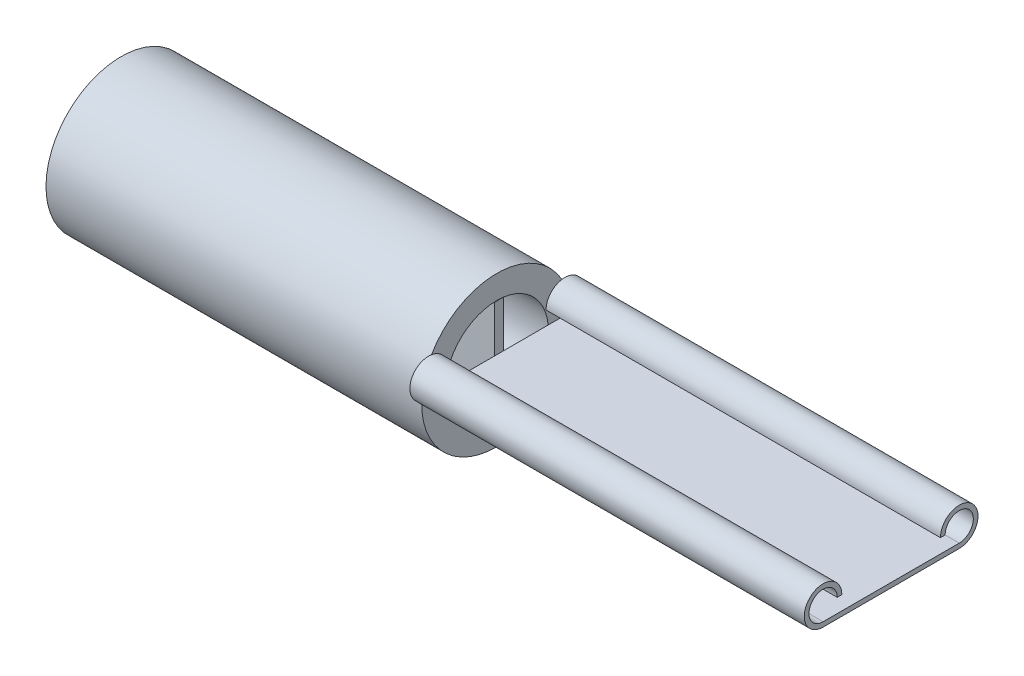
ISO-10303-21;
HEADER;
FILE_DESCRIPTION(('STEP AP214'),'2;1');
FILE_NAME('part.step','',(''),(''),'','','');
FILE_SCHEMA(('AUTOMOTIVE_DESIGN { 1 0 10303 214 1 1 1 1 }'));
ENDSEC;
DATA;
#1=APPLICATION_CONTEXT('core data for automotive mechanical design processes');
#2=APPLICATION_PROTOCOL_DEFINITION('international standard','automotive_design',2000,#1);
#3=PRODUCT_CONTEXT('',#1,'mechanical');
#4=PRODUCT('Part','Part','',(#3));
#5=PRODUCT_RELATED_PRODUCT_CATEGORY('part','',(#4));
#6=PRODUCT_DEFINITION_FORMATION('','',#4);
#7=PRODUCT_DEFINITION_CONTEXT('part definition',#1,'design');
#8=PRODUCT_DEFINITION('design','',#6,#7);
#9=PRODUCT_DEFINITION_SHAPE('','',#8);
#10=(LENGTH_UNIT() NAMED_UNIT(*) SI_UNIT(.MILLI.,.METRE.));
#11=(NAMED_UNIT(*) PLANE_ANGLE_UNIT() SI_UNIT($,.RADIAN.));
#12=(NAMED_UNIT(*) SI_UNIT($,.STERADIAN.) SOLID_ANGLE_UNIT());
#13=UNCERTAINTY_MEASURE_WITH_UNIT(LENGTH_MEASURE(1.E-05),#10,'distance_accuracy_value','');
#14=(GEOMETRIC_REPRESENTATION_CONTEXT(3) GLOBAL_UNCERTAINTY_ASSIGNED_CONTEXT((#13)) GLOBAL_UNIT_ASSIGNED_CONTEXT((#10,
#11,#12)) REPRESENTATION_CONTEXT('',''));
#15=CARTESIAN_POINT('',(0.,0.,0.));
#16=DIRECTION('',(0.,0.,1.));
#17=DIRECTION('',(1.,0.,0.));
#18=AXIS2_PLACEMENT_3D('',#15,#16,#17);
#19=CARTESIAN_POINT('',(8.,1.08987782799353,-0.148883578839629));
#20=DIRECTION('',(0.,0.,-1.));
#21=DIRECTION('',(0.,1.,0.));
#22=AXIS2_PLACEMENT_3D('',#19,#20,#21);
#23=PLANE('',#22);
#24=DIRECTION('',(0.,-1.,0.));
#25=VECTOR('',#24,1.);
#26=CARTESIAN_POINT('',(0.,1.08987782799353,-0.148883578839629));
#27=LINE('',#26,#25);
#28=CARTESIAN_POINT('',(0.,1.08987782799353,-0.148883578839629));
#29=VERTEX_POINT('',#28);
#30=CARTESIAN_POINT('',(0.,-1.09881168153954,-0.148883578839628));
#31=VERTEX_POINT('',#30);
#32=EDGE_CURVE('E108',#29,#31,#27,.T.);
#33=ORIENTED_EDGE('',*,*,#32,.F.);
#34=DIRECTION('',(-1.,0.,0.));
#35=VECTOR('',#34,1.);
#36=CARTESIAN_POINT('',(8.,1.08987782799353,-0.148883578839629));
#37=LINE('',#36,#35);
#38=CARTESIAN_POINT('',(8.,1.08987782799353,-0.148883578839629));
#39=VERTEX_POINT('',#38);
#40=EDGE_CURVE('E12',#39,#29,#37,.T.);
#41=ORIENTED_EDGE('',*,*,#40,.F.);
#42=DIRECTION('',(0.,-1.,0.));
#43=VECTOR('',#42,1.);
#44=CARTESIAN_POINT('',(8.,1.08987782799353,-0.148883578839629));
#45=LINE('',#44,#43);
#46=CARTESIAN_POINT('',(8.,-1.09881168153954,-0.148883578839628));
#47=VERTEX_POINT('',#46);
#48=EDGE_CURVE('E102',#39,#47,#45,.T.);
#49=ORIENTED_EDGE('',*,*,#48,.T.);
#50=DIRECTION('',(-1.,0.,0.));
#51=VECTOR('',#50,1.);
#52=CARTESIAN_POINT('',(8.,-1.09881168153954,-0.148883578839628));
#53=LINE('',#52,#51);
#54=EDGE_CURVE('E47',#47,#31,#53,.T.);
#55=ORIENTED_EDGE('',*,*,#54,.T.);
#56=EDGE_LOOP('',(#33,#41,#49,#55));
#57=FACE_BOUND('',#56,.T.);
#58=ADVANCED_FACE('F44',(#57),#23,.T.);
#59=CARTESIAN_POINT('',(8.,1.08987782799353,-0.148883578839629));
#60=DIRECTION('',(0.,1.,0.));
#61=DIRECTION('',(0.,0.,1.));
#62=AXIS2_PLACEMENT_3D('',#59,#60,#61);
#63=PLANE('',#62);
#64=DIRECTION('',(0.,0.,-1.));
#65=VECTOR('',#64,1.);
#66=CARTESIAN_POINT('',(0.,1.08987782799353,-0.148883578839629));
#67=LINE('',#66,#65);
#68=CARTESIAN_POINT('',(0.,1.08987782799353,0.0511164211603714));
#69=VERTEX_POINT('',#68);
#70=EDGE_CURVE('E104',#69,#29,#67,.T.);
#71=ORIENTED_EDGE('',*,*,#70,.F.);
#72=DIRECTION('',(-1.,0.,0.));
#73=VECTOR('',#72,1.);
#74=CARTESIAN_POINT('',(8.,1.08987782799353,0.0511164211603714));
#75=LINE('',#74,#73);
#76=CARTESIAN_POINT('',(8.,1.08987782799353,0.0511164211603714));
#77=VERTEX_POINT('',#76);
#78=EDGE_CURVE('E53',#77,#69,#75,.T.);
#79=ORIENTED_EDGE('',*,*,#78,.F.);
#80=DIRECTION('',(0.,0.,-1.));
#81=VECTOR('',#80,1.);
#82=CARTESIAN_POINT('',(8.,1.08987782799353,-0.148883578839629));
#83=LINE('',#82,#81);
#84=EDGE_CURVE('E99',#77,#39,#83,.T.);
#85=ORIENTED_EDGE('',*,*,#84,.T.);
#86=ORIENTED_EDGE('',*,*,#40,.T.);
#87=EDGE_LOOP('',(#71,#79,#85,#86));
#88=FACE_BOUND('',#87,.T.);
#89=ADVANCED_FACE('F118',(#88),#63,.T.);
#90=CARTESIAN_POINT('',(8.,1.08987782799353,0.0511164211603714));
#91=DIRECTION('',(0.,0.,1.));
#92=DIRECTION('',(0.,-1.,0.));
#93=AXIS2_PLACEMENT_3D('',#90,#91,#92);
#94=PLANE('',#93);
#95=DIRECTION('',(0.,1.,0.));
#96=VECTOR('',#95,1.);
#97=CARTESIAN_POINT('',(0.,1.08987782799353,0.0511164211603714));
#98=LINE('',#97,#96);
#99=CARTESIAN_POINT('',(0.,-1.09881168153954,0.0511164211603717));
#100=VERTEX_POINT('',#99);
#101=EDGE_CURVE('E94',#100,#69,#98,.T.);
#102=ORIENTED_EDGE('',*,*,#101,.F.);
#103=DIRECTION('',(-1.,0.,0.));
#104=VECTOR('',#103,1.);
#105=CARTESIAN_POINT('',(8.,-1.09881168153954,0.0511164211603717));
#106=LINE('',#105,#104);
#107=CARTESIAN_POINT('',(8.,-1.09881168153954,0.0511164211603717));
#108=VERTEX_POINT('',#107);
#109=EDGE_CURVE('E89',#108,#100,#106,.T.);
#110=ORIENTED_EDGE('',*,*,#109,.F.);
#111=DIRECTION('',(0.,1.,0.));
#112=VECTOR('',#111,1.);
#113=CARTESIAN_POINT('',(8.,1.08987782799353,0.0511164211603714));
#114=LINE('',#113,#112);
#115=EDGE_CURVE('E92',#108,#77,#114,.T.);
#116=ORIENTED_EDGE('',*,*,#115,.T.);
#117=ORIENTED_EDGE('',*,*,#78,.T.);
#118=EDGE_LOOP('',(#102,#110,#116,#117));
#119=FACE_BOUND('',#118,.T.);
#120=ADVANCED_FACE('F91',(#119),#94,.T.);
#121=CARTESIAN_POINT('',(8.,-1.09881168153954,-0.148883578839628));
#122=DIRECTION('',(0.,-1.,0.));
#123=DIRECTION('',(0.,0.,-1.));
#124=AXIS2_PLACEMENT_3D('',#121,#122,#123);
#125=PLANE('',#124);
#126=DIRECTION('',(0.,0.,1.));
#127=VECTOR('',#126,1.);
#128=CARTESIAN_POINT('',(0.,-1.09881168153954,-0.148883578839628));
#129=LINE('',#128,#127);
#130=EDGE_CURVE('E111',#31,#100,#129,.T.);
#131=ORIENTED_EDGE('',*,*,#130,.F.);
#132=ORIENTED_EDGE('',*,*,#54,.F.);
#133=DIRECTION('',(0.,0.,1.));
#134=VECTOR('',#133,1.);
#135=CARTESIAN_POINT('',(8.,-1.09881168153954,-0.148883578839628));
#136=LINE('',#135,#134);
#137=EDGE_CURVE('E98',#47,#108,#136,.T.);
#138=ORIENTED_EDGE('',*,*,#137,.T.);
#139=ORIENTED_EDGE('',*,*,#109,.T.);
#140=EDGE_LOOP('',(#131,#132,#138,#139));
#141=FACE_BOUND('',#140,.T.);
#142=ADVANCED_FACE('F101',(#141),#125,.T.);
#143=CARTESIAN_POINT('',(8.,0.,0.));
#144=DIRECTION('',(-1.,0.,0.));
#145=DIRECTION('',(0.,0.,1.));
#146=AXIS2_PLACEMENT_3D('',#143,#144,#145);
#147=PLANE('',#146);
#148=ORIENTED_EDGE('',*,*,#48,.F.);
#149=ORIENTED_EDGE('',*,*,#84,.F.);
#150=ORIENTED_EDGE('',*,*,#115,.F.);
#151=ORIENTED_EDGE('',*,*,#137,.F.);
#152=EDGE_LOOP('',(#148,#149,#150,#151));
#153=FACE_BOUND('',#152,.T.);
#154=ADVANCED_FACE('F97',(#153),#147,.F.);
#155=CARTESIAN_POINT('',(0.,0.,0.));
#156=DIRECTION('',(-1.,0.,0.));
#157=DIRECTION('',(0.,0.,1.));
#158=AXIS2_PLACEMENT_3D('',#155,#156,#157);
#159=PLANE('',#158);
#160=ORIENTED_EDGE('',*,*,#32,.T.);
#161=ORIENTED_EDGE('',*,*,#130,.T.);
#162=ORIENTED_EDGE('',*,*,#101,.T.);
#163=ORIENTED_EDGE('',*,*,#70,.T.);
#164=EDGE_LOOP('',(#160,#161,#162,#163));
#165=FACE_BOUND('',#164,.T.);
#166=ADVANCED_FACE('F117',(#165),#159,.T.);
#167=CLOSED_SHELL('',(#58,#89,#120,#142,#154,#166));
#168=MANIFOLD_SOLID_BREP('B2',#167);
#169=CARTESIAN_POINT('',(8.,0.,0.));
#170=DIRECTION('',(1.,0.,0.));
#171=DIRECTION('',(0.,0.,-1.));
#172=AXIS2_PLACEMENT_3D('',#169,#170,#171);
#173=PLANE('',#172);
#174=CARTESIAN_POINT('',(8.,0.4,1.45));
#175=DIRECTION('',(1.,0.,0.));
#176=DIRECTION('',(0.,0.,1.));
#177=AXIS2_PLACEMENT_3D('',#174,#175,#176);
#178=CIRCLE('',#177,0.4);
#179=CARTESIAN_POINT('',(8.,0.4,1.05));
#180=VERTEX_POINT('',#179);
#181=CARTESIAN_POINT('',(8.,0.795226140008558,1.38838589241143));
#182=VERTEX_POINT('',#181);
#183=EDGE_CURVE('E186',#180,#182,#178,.T.);
#184=ORIENTED_EDGE('',*,*,#183,.F.);
#185=DIRECTION('',(0.,0.,-1.));
#186=VECTOR('',#185,1.);
#187=CARTESIAN_POINT('',(8.,0.4,1.05));
#188=LINE('',#187,#186);
#189=CARTESIAN_POINT('',(8.,0.4,1.15));
#190=VERTEX_POINT('',#189);
#191=EDGE_CURVE('E293',#190,#180,#188,.T.);
#192=ORIENTED_EDGE('',*,*,#191,.F.);
#193=CARTESIAN_POINT('',(8.,0.4,1.45));
#194=DIRECTION('',(-1.,0.,0.));
#195=DIRECTION('',(0.,0.,1.));
#196=AXIS2_PLACEMENT_3D('',#193,#194,#195);
#197=CIRCLE('',#196,0.3);
#198=CARTESIAN_POINT('',(8.,0.699792734645293,1.43885028009785));
#199=VERTEX_POINT('',#198);
#200=EDGE_CURVE('E42',#199,#190,#197,.T.);
#201=ORIENTED_EDGE('',*,*,#200,.F.);
#202=CARTESIAN_POINT('',(8.,0.,0.));
#203=DIRECTION('',(1.,0.,0.));
#204=DIRECTION('',(0.,0.,-1.));
#205=AXIS2_PLACEMENT_3D('',#202,#203,#204);
#206=CIRCLE('',#205,1.6);
#207=CARTESIAN_POINT('',(8.,0.136892348227635,1.59413314531651));
#208=VERTEX_POINT('',#207);
#209=EDGE_CURVE('E330',#199,#208,#206,.T.);
#210=ORIENTED_EDGE('',*,*,#209,.T.);
#211=CARTESIAN_POINT('',(8.,0.1,1.45));
#212=VERTEX_POINT('',#211);
#213=EDGE_CURVE('E178',#212,#208,#197,.T.);
#214=ORIENTED_EDGE('',*,*,#213,.F.);
#215=DIRECTION('',(0.,0.,1.));
#216=VECTOR('',#215,1.);
#217=CARTESIAN_POINT('',(8.,0.1,1.45));
#218=LINE('',#217,#216);
#219=CARTESIAN_POINT('',(8.,0.1,1.09544511501033));
#220=VERTEX_POINT('',#219);
#221=EDGE_CURVE('E176',#220,#212,#218,.T.);
#222=ORIENTED_EDGE('',*,*,#221,.F.);
#223=CARTESIAN_POINT('',(8.,0.,0.));
#224=DIRECTION('',(1.,0.,0.));
#225=DIRECTION('',(0.,0.,-1.));
#226=AXIS2_PLACEMENT_3D('',#223,#224,#225);
#227=CIRCLE('',#226,1.1);
#228=CARTESIAN_POINT('',(8.,0.1,-1.09544511501033));
#229=VERTEX_POINT('',#228);
#230=EDGE_CURVE('E310',#229,#220,#227,.T.);
#231=ORIENTED_EDGE('',*,*,#230,.F.);
#232=CARTESIAN_POINT('',(8.,0.1,-1.45));
#233=VERTEX_POINT('',#232);
#234=EDGE_CURVE('E390',#233,#229,#218,.T.);
#235=ORIENTED_EDGE('',*,*,#234,.F.);
#236=CARTESIAN_POINT('',(8.,0.4,-1.45));
#237=DIRECTION('',(-1.,0.,0.));
#238=DIRECTION('',(0.,0.,-1.));
#239=AXIS2_PLACEMENT_3D('',#236,#237,#238);
#240=CIRCLE('',#239,0.3);
#241=CARTESIAN_POINT('',(8.,0.136892348227635,-1.59413314531651));
#242=VERTEX_POINT('',#241);
#243=EDGE_CURVE('E389',#242,#233,#240,.T.);
#244=ORIENTED_EDGE('',*,*,#243,.F.);
#245=CARTESIAN_POINT('',(8.,0.699792734645293,-1.43885028009785));
#246=VERTEX_POINT('',#245);
#247=EDGE_CURVE('E314',#242,#246,#206,.T.);
#248=ORIENTED_EDGE('',*,*,#247,.T.);
#249=CARTESIAN_POINT('',(8.,0.4,-1.15));
#250=VERTEX_POINT('',#249);
#251=EDGE_CURVE('E385',#250,#246,#240,.T.);
#252=ORIENTED_EDGE('',*,*,#251,.F.);
#253=DIRECTION('',(0.,0.,-1.));
#254=VECTOR('',#253,1.);
#255=CARTESIAN_POINT('',(8.,0.4,-1.05));
#256=LINE('',#255,#254);
#257=CARTESIAN_POINT('',(8.,0.4,-1.05));
#258=VERTEX_POINT('',#257);
#259=EDGE_CURVE('E381',#258,#250,#256,.T.);
#260=ORIENTED_EDGE('',*,*,#259,.F.);
#261=CARTESIAN_POINT('',(8.,0.4,-1.45));
#262=DIRECTION('',(1.,0.,0.));
#263=DIRECTION('',(0.,0.,-1.));
#264=AXIS2_PLACEMENT_3D('',#261,#262,#263);
#265=CIRCLE('',#264,0.4);
#266=CARTESIAN_POINT('',(8.,0.795226140008558,-1.38838589241143));
#267=VERTEX_POINT('',#266);
#268=EDGE_CURVE('E364',#267,#258,#265,.T.);
#269=ORIENTED_EDGE('',*,*,#268,.F.);
#270=EDGE_CURVE('E424',#267,#182,#206,.T.);
#271=ORIENTED_EDGE('',*,*,#270,.T.);
#272=EDGE_LOOP('',(#184,#192,#201,#210,#214,#222,#231,#235,#244,#248,#252,#260,#269,#271));
#273=FACE_BOUND('',#272,.T.);
#274=ADVANCED_FACE('F167',(#273),#173,.T.);
#275=CARTESIAN_POINT('',(8.,0.0290832522566356,1.59973565454989));
#276=VERTEX_POINT('',#275);
#277=CARTESIAN_POINT('',(8.,0.,1.45));
#278=VERTEX_POINT('',#277);
#279=EDGE_CURVE('E298',#276,#278,#178,.T.);
#280=ORIENTED_EDGE('',*,*,#279,.F.);
#281=CARTESIAN_POINT('',(8.,0.0290832522566356,-1.59973565454989));
#282=VERTEX_POINT('',#281);
#283=EDGE_CURVE('E315',#276,#282,#206,.T.);
#284=ORIENTED_EDGE('',*,*,#283,.T.);
#285=CARTESIAN_POINT('',(8.,0.,-1.45));
#286=VERTEX_POINT('',#285);
#287=EDGE_CURVE('E378',#286,#282,#265,.T.);
#288=ORIENTED_EDGE('',*,*,#287,.F.);
#289=DIRECTION('',(0.,0.,-1.));
#290=VECTOR('',#289,1.);
#291=CARTESIAN_POINT('',(8.,0.,1.45));
#292=LINE('',#291,#290);
#293=CARTESIAN_POINT('',(8.,0.,-1.1));
#294=VERTEX_POINT('',#293);
#295=EDGE_CURVE('E313',#294,#286,#292,.T.);
#296=ORIENTED_EDGE('',*,*,#295,.F.);
#297=CARTESIAN_POINT('',(8.,0.,1.1));
#298=VERTEX_POINT('',#297);
#299=EDGE_CURVE('E302',#298,#294,#227,.T.);
#300=ORIENTED_EDGE('',*,*,#299,.F.);
#301=EDGE_CURVE('E322',#278,#298,#292,.T.);
#302=ORIENTED_EDGE('',*,*,#301,.F.);
#303=EDGE_LOOP('',(#280,#284,#288,#296,#300,#302));
#304=FACE_BOUND('',#303,.T.);
#305=ADVANCED_FACE('F338',(#304),#173,.T.);
#306=CARTESIAN_POINT('',(0.,0.,0.));
#307=DIRECTION('',(1.,0.,0.));
#308=DIRECTION('',(0.,0.,-1.));
#309=AXIS2_PLACEMENT_3D('',#306,#307,#308);
#310=PLANE('',#309);
#311=CARTESIAN_POINT('',(0.,0.,0.));
#312=DIRECTION('',(1.,0.,0.));
#313=DIRECTION('',(0.,0.,-1.));
#314=AXIS2_PLACEMENT_3D('',#311,#312,#313);
#315=CIRCLE('',#314,1.6);
#316=CARTESIAN_POINT('',(0.,0.,-1.6));
#317=VERTEX_POINT('',#316);
#318=EDGE_CURVE('E171',#317,#317,#315,.T.);
#319=ORIENTED_EDGE('',*,*,#318,.F.);
#320=EDGE_LOOP('',(#319));
#321=FACE_BOUND('',#320,.T.);
#322=CARTESIAN_POINT('',(0.,0.,0.));
#323=DIRECTION('',(1.,0.,0.));
#324=DIRECTION('',(0.,0.,-1.));
#325=AXIS2_PLACEMENT_3D('',#322,#323,#324);
#326=CIRCLE('',#325,1.1);
#327=CARTESIAN_POINT('',(0.,0.,-1.1));
#328=VERTEX_POINT('',#327);
#329=EDGE_CURVE('E299',#328,#328,#326,.T.);
#330=ORIENTED_EDGE('',*,*,#329,.T.);
#331=EDGE_LOOP('',(#330));
#332=FACE_BOUND('',#331,.T.);
#333=ADVANCED_FACE('F335',(#321,#332),#310,.F.);
#334=CARTESIAN_POINT('',(8.,0.,0.));
#335=DIRECTION('',(-1.,0.,0.));
#336=DIRECTION('',(0.,0.,1.));
#337=AXIS2_PLACEMENT_3D('',#334,#335,#336);
#338=CYLINDRICAL_SURFACE('',#337,1.6);
#339=EDGE_CURVE('E311',#282,#242,#206,.T.);
#340=ORIENTED_EDGE('',*,*,#339,.F.);
#341=ORIENTED_EDGE('',*,*,#283,.F.);
#342=EDGE_CURVE('E326',#208,#276,#206,.T.);
#343=ORIENTED_EDGE('',*,*,#342,.F.);
#344=ORIENTED_EDGE('',*,*,#209,.F.);
#345=EDGE_CURVE('E425',#182,#199,#206,.T.);
#346=ORIENTED_EDGE('',*,*,#345,.F.);
#347=ORIENTED_EDGE('',*,*,#270,.F.);
#348=EDGE_CURVE('E325',#246,#267,#206,.T.);
#349=ORIENTED_EDGE('',*,*,#348,.F.);
#350=ORIENTED_EDGE('',*,*,#247,.F.);
#351=EDGE_LOOP('',(#340,#341,#343,#344,#346,#347,#349,#350));
#352=FACE_BOUND('',#351,.T.);
#353=ORIENTED_EDGE('',*,*,#318,.T.);
#354=EDGE_LOOP('',(#353));
#355=FACE_BOUND('',#354,.T.);
#356=ADVANCED_FACE('F169',(#352,#355),#338,.T.);
#357=CARTESIAN_POINT('',(8.,0.,0.));
#358=DIRECTION('',(-1.,0.,0.));
#359=DIRECTION('',(0.,0.,1.));
#360=AXIS2_PLACEMENT_3D('',#357,#358,#359);
#361=CYLINDRICAL_SURFACE('',#360,1.1);
#362=EDGE_CURVE('E308',#294,#229,#227,.T.);
#363=ORIENTED_EDGE('',*,*,#362,.T.);
#364=ORIENTED_EDGE('',*,*,#230,.T.);
#365=EDGE_CURVE('E449',#220,#298,#227,.T.);
#366=ORIENTED_EDGE('',*,*,#365,.T.);
#367=ORIENTED_EDGE('',*,*,#299,.T.);
#368=EDGE_LOOP('',(#363,#364,#366,#367));
#369=FACE_BOUND('',#368,.T.);
#370=ORIENTED_EDGE('',*,*,#329,.F.);
#371=EDGE_LOOP('',(#370));
#372=FACE_BOUND('',#371,.T.);
#373=ADVANCED_FACE('F341',(#369,#372),#361,.F.);
#374=CARTESIAN_POINT('',(8.,0.4,1.45));
#375=DIRECTION('',(-1.,0.,0.));
#376=DIRECTION('',(0.,0.,1.));
#377=AXIS2_PLACEMENT_3D('',#374,#375,#376);
#378=PLANE('',#377);
#379=ORIENTED_EDGE('',*,*,#362,.F.);
#380=EDGE_CURVE('E323',#298,#294,#292,.T.);
#381=ORIENTED_EDGE('',*,*,#380,.F.);
#382=ORIENTED_EDGE('',*,*,#365,.F.);
#383=EDGE_CURVE('E388',#229,#220,#218,.T.);
#384=ORIENTED_EDGE('',*,*,#383,.F.);
#385=EDGE_LOOP('',(#379,#381,#382,#384));
#386=FACE_BOUND('',#385,.T.);
#387=ADVANCED_FACE('F343',(#386),#378,.T.);
#388=EDGE_CURVE('E377',#282,#267,#265,.T.);
#389=ORIENTED_EDGE('',*,*,#388,.F.);
#390=ORIENTED_EDGE('',*,*,#339,.T.);
#391=EDGE_CURVE('E384',#246,#242,#240,.T.);
#392=ORIENTED_EDGE('',*,*,#391,.F.);
#393=ORIENTED_EDGE('',*,*,#348,.T.);
#394=EDGE_LOOP('',(#389,#390,#392,#393));
#395=FACE_BOUND('',#394,.T.);
#396=ADVANCED_FACE('F350',(#395),#378,.T.);
#397=CARTESIAN_POINT('',(16.4,0.4,1.45));
#398=DIRECTION('',(-1.,0.,0.));
#399=DIRECTION('',(0.,0.,1.));
#400=AXIS2_PLACEMENT_3D('',#397,#398,#399);
#401=CYLINDRICAL_SURFACE('',#400,0.4);
#402=ORIENTED_EDGE('',*,*,#183,.T.);
#403=EDGE_CURVE('E366',#182,#276,#178,.T.);
#404=ORIENTED_EDGE('',*,*,#403,.T.);
#405=ORIENTED_EDGE('',*,*,#279,.T.);
#406=DIRECTION('',(-1.,0.,0.));
#407=VECTOR('',#406,1.);
#408=CARTESIAN_POINT('',(16.4,0.,1.45));
#409=LINE('',#408,#407);
#410=CARTESIAN_POINT('',(16.4,0.,1.45));
#411=VERTEX_POINT('',#410);
#412=EDGE_CURVE('E277',#411,#278,#409,.T.);
#413=ORIENTED_EDGE('',*,*,#412,.F.);
#414=CARTESIAN_POINT('',(16.4,0.4,1.45));
#415=DIRECTION('',(1.,0.,0.));
#416=DIRECTION('',(0.,0.,1.));
#417=AXIS2_PLACEMENT_3D('',#414,#415,#416);
#418=CIRCLE('',#417,0.4);
#419=CARTESIAN_POINT('',(16.4,0.4,1.05));
#420=VERTEX_POINT('',#419);
#421=EDGE_CURVE('E284',#420,#411,#418,.T.);
#422=ORIENTED_EDGE('',*,*,#421,.F.);
#423=DIRECTION('',(-1.,0.,0.));
#424=VECTOR('',#423,1.);
#425=CARTESIAN_POINT('',(16.4,0.4,1.05));
#426=LINE('',#425,#424);
#427=EDGE_CURVE('E394',#420,#180,#426,.T.);
#428=ORIENTED_EDGE('',*,*,#427,.T.);
#429=EDGE_LOOP('',(#402,#404,#405,#413,#422,#428));
#430=FACE_BOUND('',#429,.T.);
#431=ADVANCED_FACE('F296',(#430),#401,.T.);
#432=CARTESIAN_POINT('',(16.4,0.,1.45));
#433=DIRECTION('',(0.,1.,0.));
#434=DIRECTION('',(0.,0.,1.));
#435=AXIS2_PLACEMENT_3D('',#432,#433,#434);
#436=PLANE('',#435);
#437=ORIENTED_EDGE('',*,*,#301,.T.);
#438=ORIENTED_EDGE('',*,*,#380,.T.);
#439=ORIENTED_EDGE('',*,*,#295,.T.);
#440=DIRECTION('',(-1.,0.,0.));
#441=VECTOR('',#440,1.);
#442=CARTESIAN_POINT('',(16.4,0.,-1.45));
#443=LINE('',#442,#441);
#444=CARTESIAN_POINT('',(16.4,0.,-1.45));
#445=VERTEX_POINT('',#444);
#446=EDGE_CURVE('E280',#445,#286,#443,.T.);
#447=ORIENTED_EDGE('',*,*,#446,.F.);
#448=DIRECTION('',(0.,0.,-1.));
#449=VECTOR('',#448,1.);
#450=CARTESIAN_POINT('',(16.4,0.,1.45));
#451=LINE('',#450,#449);
#452=EDGE_CURVE('E272',#411,#445,#451,.T.);
#453=ORIENTED_EDGE('',*,*,#452,.F.);
#454=ORIENTED_EDGE('',*,*,#412,.T.);
#455=EDGE_LOOP('',(#437,#438,#439,#447,#453,#454));
#456=FACE_BOUND('',#455,.T.);
#457=ADVANCED_FACE('F275',(#456),#436,.F.);
#458=CARTESIAN_POINT('',(16.4,0.4,-1.45));
#459=DIRECTION('',(-1.,0.,0.));
#460=DIRECTION('',(0.,0.,1.));
#461=AXIS2_PLACEMENT_3D('',#458,#459,#460);
#462=CYLINDRICAL_SURFACE('',#461,0.4);
#463=ORIENTED_EDGE('',*,*,#287,.T.);
#464=ORIENTED_EDGE('',*,*,#388,.T.);
#465=ORIENTED_EDGE('',*,*,#268,.T.);
#466=DIRECTION('',(-1.,0.,0.));
#467=VECTOR('',#466,1.);
#468=CARTESIAN_POINT('',(16.4,0.4,-1.05));
#469=LINE('',#468,#467);
#470=CARTESIAN_POINT('',(16.4,0.4,-1.05));
#471=VERTEX_POINT('',#470);
#472=EDGE_CURVE('E304',#471,#258,#469,.T.);
#473=ORIENTED_EDGE('',*,*,#472,.F.);
#474=CARTESIAN_POINT('',(16.4,0.4,-1.45));
#475=DIRECTION('',(1.,0.,0.));
#476=DIRECTION('',(0.,0.,-1.));
#477=AXIS2_PLACEMENT_3D('',#474,#475,#476);
#478=CIRCLE('',#477,0.4);
#479=EDGE_CURVE('E283',#445,#471,#478,.T.);
#480=ORIENTED_EDGE('',*,*,#479,.F.);
#481=ORIENTED_EDGE('',*,*,#446,.T.);
#482=EDGE_LOOP('',(#463,#464,#465,#473,#480,#481));
#483=FACE_BOUND('',#482,.T.);
#484=ADVANCED_FACE('F416',(#483),#462,.T.);
#485=CARTESIAN_POINT('',(16.4,0.4,-1.05));
#486=DIRECTION('',(0.,1.,0.));
#487=DIRECTION('',(0.,0.,1.));
#488=AXIS2_PLACEMENT_3D('',#485,#486,#487);
#489=PLANE('',#488);
#490=ORIENTED_EDGE('',*,*,#259,.T.);
#491=DIRECTION('',(-1.,0.,0.));
#492=VECTOR('',#491,1.);
#493=CARTESIAN_POINT('',(16.4,0.4,-1.15));
#494=LINE('',#493,#492);
#495=CARTESIAN_POINT('',(16.4,0.4,-1.15));
#496=VERTEX_POINT('',#495);
#497=EDGE_CURVE('E405',#496,#250,#494,.T.);
#498=ORIENTED_EDGE('',*,*,#497,.F.);
#499=DIRECTION('',(0.,0.,-1.));
#500=VECTOR('',#499,1.);
#501=CARTESIAN_POINT('',(16.4,0.4,-1.05));
#502=LINE('',#501,#500);
#503=EDGE_CURVE('E413',#471,#496,#502,.T.);
#504=ORIENTED_EDGE('',*,*,#503,.F.);
#505=ORIENTED_EDGE('',*,*,#472,.T.);
#506=EDGE_LOOP('',(#490,#498,#504,#505));
#507=FACE_BOUND('',#506,.T.);
#508=ADVANCED_FACE('F411',(#507),#489,.F.);
#509=CARTESIAN_POINT('',(16.4,0.4,-1.45));
#510=DIRECTION('',(-1.,0.,0.));
#511=DIRECTION('',(0.,0.,1.));
#512=AXIS2_PLACEMENT_3D('',#509,#510,#511);
#513=CYLINDRICAL_SURFACE('',#512,0.3);
#514=ORIENTED_EDGE('',*,*,#251,.T.);
#515=ORIENTED_EDGE('',*,*,#391,.T.);
#516=ORIENTED_EDGE('',*,*,#243,.T.);
#517=DIRECTION('',(-1.,0.,0.));
#518=VECTOR('',#517,1.);
#519=CARTESIAN_POINT('',(16.4,0.1,-1.45));
#520=LINE('',#519,#518);
#521=CARTESIAN_POINT('',(16.4,0.1,-1.45));
#522=VERTEX_POINT('',#521);
#523=EDGE_CURVE('E402',#522,#233,#520,.T.);
#524=ORIENTED_EDGE('',*,*,#523,.F.);
#525=CARTESIAN_POINT('',(16.4,0.4,-1.45));
#526=DIRECTION('',(-1.,0.,0.));
#527=DIRECTION('',(0.,0.,-1.));
#528=AXIS2_PLACEMENT_3D('',#525,#526,#527);
#529=CIRCLE('',#528,0.3);
#530=EDGE_CURVE('E434',#496,#522,#529,.T.);
#531=ORIENTED_EDGE('',*,*,#530,.F.);
#532=ORIENTED_EDGE('',*,*,#497,.T.);
#533=EDGE_LOOP('',(#514,#515,#516,#524,#531,#532));
#534=FACE_BOUND('',#533,.T.);
#535=ADVANCED_FACE('F422',(#534),#513,.F.);
#536=CARTESIAN_POINT('',(16.4,0.1,1.45));
#537=DIRECTION('',(0.,-1.,0.));
#538=DIRECTION('',(0.,0.,-1.));
#539=AXIS2_PLACEMENT_3D('',#536,#537,#538);
#540=PLANE('',#539);
#541=ORIENTED_EDGE('',*,*,#234,.T.);
#542=ORIENTED_EDGE('',*,*,#383,.T.);
#543=ORIENTED_EDGE('',*,*,#221,.T.);
#544=DIRECTION('',(-1.,0.,0.));
#545=VECTOR('',#544,1.);
#546=CARTESIAN_POINT('',(16.4,0.1,1.45));
#547=LINE('',#546,#545);
#548=CARTESIAN_POINT('',(16.4,0.1,1.45));
#549=VERTEX_POINT('',#548);
#550=EDGE_CURVE('E399',#549,#212,#547,.T.);
#551=ORIENTED_EDGE('',*,*,#550,.F.);
#552=DIRECTION('',(0.,0.,1.));
#553=VECTOR('',#552,1.);
#554=CARTESIAN_POINT('',(16.4,0.1,1.45));
#555=LINE('',#554,#553);
#556=EDGE_CURVE('E433',#522,#549,#555,.T.);
#557=ORIENTED_EDGE('',*,*,#556,.F.);
#558=ORIENTED_EDGE('',*,*,#523,.T.);
#559=EDGE_LOOP('',(#541,#542,#543,#551,#557,#558));
#560=FACE_BOUND('',#559,.T.);
#561=ADVANCED_FACE('F443',(#560),#540,.F.);
#562=CARTESIAN_POINT('',(16.4,0.4,1.45));
#563=DIRECTION('',(-1.,0.,0.));
#564=DIRECTION('',(0.,0.,1.));
#565=AXIS2_PLACEMENT_3D('',#562,#563,#564);
#566=CYLINDRICAL_SURFACE('',#565,0.3);
#567=ORIENTED_EDGE('',*,*,#213,.T.);
#568=EDGE_CURVE('E179',#208,#199,#197,.T.);
#569=ORIENTED_EDGE('',*,*,#568,.T.);
#570=ORIENTED_EDGE('',*,*,#200,.T.);
#571=DIRECTION('',(-1.,0.,0.));
#572=VECTOR('',#571,1.);
#573=CARTESIAN_POINT('',(16.4,0.4,1.15));
#574=LINE('',#573,#572);
#575=CARTESIAN_POINT('',(16.4,0.4,1.15));
#576=VERTEX_POINT('',#575);
#577=EDGE_CURVE('E396',#576,#190,#574,.T.);
#578=ORIENTED_EDGE('',*,*,#577,.F.);
#579=CARTESIAN_POINT('',(16.4,0.4,1.45));
#580=DIRECTION('',(-1.,0.,0.));
#581=DIRECTION('',(0.,0.,1.));
#582=AXIS2_PLACEMENT_3D('',#579,#580,#581);
#583=CIRCLE('',#582,0.3);
#584=EDGE_CURVE('E432',#549,#576,#583,.T.);
#585=ORIENTED_EDGE('',*,*,#584,.F.);
#586=ORIENTED_EDGE('',*,*,#550,.T.);
#587=EDGE_LOOP('',(#567,#569,#570,#578,#585,#586));
#588=FACE_BOUND('',#587,.T.);
#589=ADVANCED_FACE('F428',(#588),#566,.F.);
#590=CARTESIAN_POINT('',(16.4,0.4,1.05));
#591=DIRECTION('',(0.,1.,0.));
#592=DIRECTION('',(0.,0.,1.));
#593=AXIS2_PLACEMENT_3D('',#590,#591,#592);
#594=PLANE('',#593);
#595=ORIENTED_EDGE('',*,*,#191,.T.);
#596=ORIENTED_EDGE('',*,*,#427,.F.);
#597=DIRECTION('',(0.,0.,-1.));
#598=VECTOR('',#597,1.);
#599=CARTESIAN_POINT('',(16.4,0.4,1.05));
#600=LINE('',#599,#598);
#601=EDGE_CURVE('E289',#576,#420,#600,.T.);
#602=ORIENTED_EDGE('',*,*,#601,.F.);
#603=ORIENTED_EDGE('',*,*,#577,.T.);
#604=EDGE_LOOP('',(#595,#596,#602,#603));
#605=FACE_BOUND('',#604,.T.);
#606=ADVANCED_FACE('F431',(#605),#594,.F.);
#607=CARTESIAN_POINT('',(16.4,0.4,1.45));
#608=DIRECTION('',(-1.,0.,0.));
#609=DIRECTION('',(0.,0.,1.));
#610=AXIS2_PLACEMENT_3D('',#607,#608,#609);
#611=PLANE('',#610);
#612=ORIENTED_EDGE('',*,*,#421,.T.);
#613=ORIENTED_EDGE('',*,*,#452,.T.);
#614=ORIENTED_EDGE('',*,*,#479,.T.);
#615=ORIENTED_EDGE('',*,*,#503,.T.);
#616=ORIENTED_EDGE('',*,*,#530,.T.);
#617=ORIENTED_EDGE('',*,*,#556,.T.);
#618=ORIENTED_EDGE('',*,*,#584,.T.);
#619=ORIENTED_EDGE('',*,*,#601,.T.);
#620=EDGE_LOOP('',(#612,#613,#614,#615,#616,#617,#618,#619));
#621=FACE_BOUND('',#620,.T.);
#622=ADVANCED_FACE('F287',(#621),#611,.F.);
#623=ORIENTED_EDGE('',*,*,#403,.F.);
#624=ORIENTED_EDGE('',*,*,#345,.T.);
#625=ORIENTED_EDGE('',*,*,#568,.F.);
#626=ORIENTED_EDGE('',*,*,#342,.T.);
#627=EDGE_LOOP('',(#623,#624,#625,#626));
#628=FACE_BOUND('',#627,.T.);
#629=ADVANCED_FACE('F353',(#628),#378,.T.);
#630=CLOSED_SHELL('',(#274,#305,#333,#356,#373,#387,#396,#431,#457,#484,#508,#535,#561,#589,
#606,#622,#629));
#631=MANIFOLD_SOLID_BREP('B6',#630);
#632=ADVANCED_BREP_SHAPE_REPRESENTATION('',(#18,#168,#631),#14);
#633=SHAPE_DEFINITION_REPRESENTATION(#9,#632);
ENDSEC;
END-ISO-10303-21;
